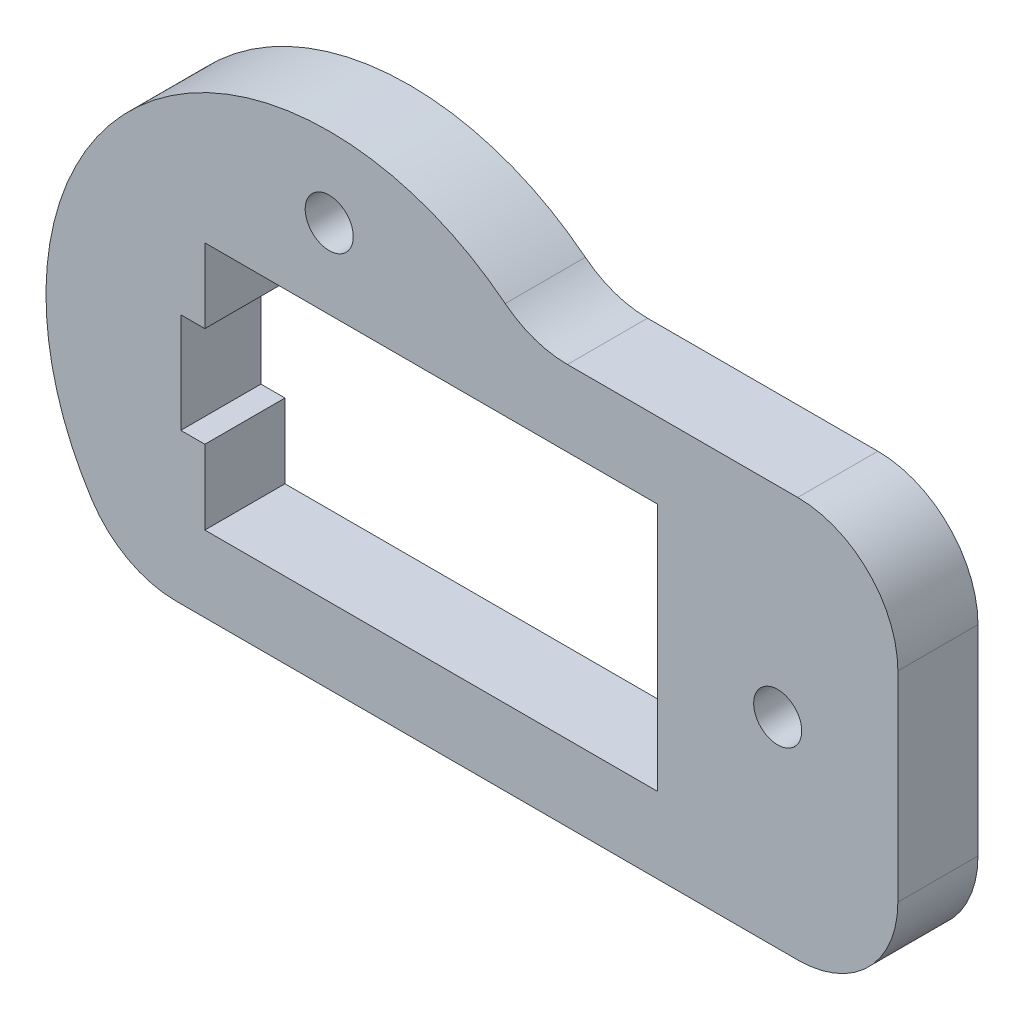
ISO-10303-21;
HEADER;
FILE_DESCRIPTION(('STEP AP214'),'2;1');
FILE_NAME('part.step','',(''),(''),'','','');
FILE_SCHEMA(('AUTOMOTIVE_DESIGN { 1 0 10303 214 1 1 1 1 }'));
ENDSEC;
DATA;
#1=APPLICATION_CONTEXT('core data for automotive mechanical design processes');
#2=APPLICATION_PROTOCOL_DEFINITION('international standard','automotive_design',2000,#1);
#3=PRODUCT_CONTEXT('',#1,'mechanical');
#4=PRODUCT('Part','Part','',(#3));
#5=PRODUCT_RELATED_PRODUCT_CATEGORY('part','',(#4));
#6=PRODUCT_DEFINITION_FORMATION('','',#4);
#7=PRODUCT_DEFINITION_CONTEXT('part definition',#1,'design');
#8=PRODUCT_DEFINITION('design','',#6,#7);
#9=PRODUCT_DEFINITION_SHAPE('','',#8);
#10=(LENGTH_UNIT() NAMED_UNIT(*) SI_UNIT(.MILLI.,.METRE.));
#11=(NAMED_UNIT(*) PLANE_ANGLE_UNIT() SI_UNIT($,.RADIAN.));
#12=(NAMED_UNIT(*) SI_UNIT($,.STERADIAN.) SOLID_ANGLE_UNIT());
#13=UNCERTAINTY_MEASURE_WITH_UNIT(LENGTH_MEASURE(1.E-05),#10,'distance_accuracy_value','');
#14=(GEOMETRIC_REPRESENTATION_CONTEXT(3) GLOBAL_UNCERTAINTY_ASSIGNED_CONTEXT((#13)) GLOBAL_UNIT_ASSIGNED_CONTEXT((#10,
#11,#12)) REPRESENTATION_CONTEXT('',''));
#15=CARTESIAN_POINT('',(0.,0.,0.));
#16=DIRECTION('',(0.,0.,1.));
#17=DIRECTION('',(1.,0.,0.));
#18=AXIS2_PLACEMENT_3D('',#15,#16,#17);
#19=CARTESIAN_POINT('',(0.,16.21,4.));
#20=DIRECTION('',(0.,1.,0.));
#21=DIRECTION('',(0.,0.,1.));
#22=AXIS2_PLACEMENT_3D('',#19,#20,#21);
#23=PLANE('',#22);
#24=DIRECTION('',(1.,0.,0.));
#25=VECTOR('',#24,1.);
#26=CARTESIAN_POINT('',(0.,16.21,0.));
#27=LINE('',#26,#25);
#28=CARTESIAN_POINT('',(3.78999999999999,16.21,0.));
#29=VERTEX_POINT('',#28);
#30=CARTESIAN_POINT('',(26.39,16.21,0.));
#31=VERTEX_POINT('',#30);
#32=EDGE_CURVE('E174',#29,#31,#27,.T.);
#33=ORIENTED_EDGE('',*,*,#32,.T.);
#34=DIRECTION('',(0.,0.,-1.));
#35=VECTOR('',#34,1.);
#36=CARTESIAN_POINT('',(26.39,16.21,4.));
#37=LINE('',#36,#35);
#38=CARTESIAN_POINT('',(26.39,16.21,4.));
#39=VERTEX_POINT('',#38);
#40=EDGE_CURVE('E154',#39,#31,#37,.T.);
#41=ORIENTED_EDGE('',*,*,#40,.F.);
#42=DIRECTION('',(1.,0.,0.));
#43=VECTOR('',#42,1.);
#44=CARTESIAN_POINT('',(0.,16.21,4.));
#45=LINE('',#44,#43);
#46=CARTESIAN_POINT('',(3.78999999999999,16.21,4.));
#47=VERTEX_POINT('',#46);
#48=EDGE_CURVE('E161',#47,#39,#45,.T.);
#49=ORIENTED_EDGE('',*,*,#48,.F.);
#50=DIRECTION('',(0.,0.,-1.));
#51=VECTOR('',#50,1.);
#52=CARTESIAN_POINT('',(3.78999999999999,16.21,4.));
#53=LINE('',#52,#51);
#54=EDGE_CURVE('E263',#47,#29,#53,.T.);
#55=ORIENTED_EDGE('',*,*,#54,.T.);
#56=EDGE_LOOP('',(#33,#41,#49,#55));
#57=FACE_BOUND('',#56,.T.);
#58=ADVANCED_FACE('F35',(#57),#23,.F.);
#59=CARTESIAN_POINT('',(26.39,0.,4.));
#60=DIRECTION('',(1.,0.,0.));
#61=DIRECTION('',(0.,0.,-1.));
#62=AXIS2_PLACEMENT_3D('',#59,#60,#61);
#63=PLANE('',#62);
#64=DIRECTION('',(0.,-1.,0.));
#65=VECTOR('',#64,1.);
#66=CARTESIAN_POINT('',(26.39,0.,0.));
#67=LINE('',#66,#65);
#68=CARTESIAN_POINT('',(26.39,3.79,0.));
#69=VERTEX_POINT('',#68);
#70=EDGE_CURVE('E275',#31,#69,#67,.T.);
#71=ORIENTED_EDGE('',*,*,#70,.T.);
#72=DIRECTION('',(0.,0.,-1.));
#73=VECTOR('',#72,1.);
#74=CARTESIAN_POINT('',(26.39,3.79,4.));
#75=LINE('',#74,#73);
#76=CARTESIAN_POINT('',(26.39,3.79,4.));
#77=VERTEX_POINT('',#76);
#78=EDGE_CURVE('E156',#77,#69,#75,.T.);
#79=ORIENTED_EDGE('',*,*,#78,.F.);
#80=DIRECTION('',(0.,-1.,0.));
#81=VECTOR('',#80,1.);
#82=CARTESIAN_POINT('',(26.39,0.,4.));
#83=LINE('',#82,#81);
#84=EDGE_CURVE('E149',#39,#77,#83,.T.);
#85=ORIENTED_EDGE('',*,*,#84,.F.);
#86=ORIENTED_EDGE('',*,*,#40,.T.);
#87=EDGE_LOOP('',(#71,#79,#85,#86));
#88=FACE_BOUND('',#87,.T.);
#89=ADVANCED_FACE('F152',(#88),#63,.F.);
#90=CARTESIAN_POINT('',(0.,3.79,4.));
#91=DIRECTION('',(0.,1.,0.));
#92=DIRECTION('',(-1.,0.,0.));
#93=AXIS2_PLACEMENT_3D('',#90,#91,#92);
#94=PLANE('',#93);
#95=DIRECTION('',(1.,0.,0.));
#96=VECTOR('',#95,1.);
#97=CARTESIAN_POINT('',(0.,3.79,0.));
#98=LINE('',#97,#96);
#99=CARTESIAN_POINT('',(3.78999999999999,3.79,0.));
#100=VERTEX_POINT('',#99);
#101=EDGE_CURVE('E277',#100,#69,#98,.T.);
#102=ORIENTED_EDGE('',*,*,#101,.F.);
#103=DIRECTION('',(0.,0.,-1.));
#104=VECTOR('',#103,1.);
#105=CARTESIAN_POINT('',(3.78999999999999,3.79,4.));
#106=LINE('',#105,#104);
#107=CARTESIAN_POINT('',(3.78999999999999,3.79,4.));
#108=VERTEX_POINT('',#107);
#109=EDGE_CURVE('E179',#108,#100,#106,.T.);
#110=ORIENTED_EDGE('',*,*,#109,.F.);
#111=DIRECTION('',(1.,0.,0.));
#112=VECTOR('',#111,1.);
#113=CARTESIAN_POINT('',(0.,3.79,4.));
#114=LINE('',#113,#112);
#115=EDGE_CURVE('E160',#108,#77,#114,.T.);
#116=ORIENTED_EDGE('',*,*,#115,.T.);
#117=ORIENTED_EDGE('',*,*,#78,.T.);
#118=EDGE_LOOP('',(#102,#110,#116,#117));
#119=FACE_BOUND('',#118,.T.);
#120=ADVANCED_FACE('F309',(#119),#94,.T.);
#121=CARTESIAN_POINT('',(3.78999999999999,0.,4.));
#122=DIRECTION('',(1.,0.,0.));
#123=DIRECTION('',(0.,1.,0.));
#124=AXIS2_PLACEMENT_3D('',#121,#122,#123);
#125=PLANE('',#124);
#126=DIRECTION('',(0.,-1.,0.));
#127=VECTOR('',#126,1.);
#128=CARTESIAN_POINT('',(3.78999999999999,0.,0.));
#129=LINE('',#128,#127);
#130=CARTESIAN_POINT('',(3.78999999999999,7.5,0.));
#131=VERTEX_POINT('',#130);
#132=EDGE_CURVE('E280',#131,#100,#129,.T.);
#133=ORIENTED_EDGE('',*,*,#132,.F.);
#134=DIRECTION('',(0.,0.,-1.));
#135=VECTOR('',#134,1.);
#136=CARTESIAN_POINT('',(3.78999999999999,7.5,4.));
#137=LINE('',#136,#135);
#138=CARTESIAN_POINT('',(3.78999999999999,7.5,4.));
#139=VERTEX_POINT('',#138);
#140=EDGE_CURVE('E302',#139,#131,#137,.T.);
#141=ORIENTED_EDGE('',*,*,#140,.F.);
#142=DIRECTION('',(0.,-1.,0.));
#143=VECTOR('',#142,1.);
#144=CARTESIAN_POINT('',(3.78999999999999,0.,4.));
#145=LINE('',#144,#143);
#146=EDGE_CURVE('E250',#139,#108,#145,.T.);
#147=ORIENTED_EDGE('',*,*,#146,.T.);
#148=ORIENTED_EDGE('',*,*,#109,.T.);
#149=EDGE_LOOP('',(#133,#141,#147,#148));
#150=FACE_BOUND('',#149,.T.);
#151=ADVANCED_FACE('F306',(#150),#125,.T.);
#152=CARTESIAN_POINT('',(0.,7.5,4.));
#153=DIRECTION('',(0.,-1.,0.));
#154=DIRECTION('',(0.,0.,-1.));
#155=AXIS2_PLACEMENT_3D('',#152,#153,#154);
#156=PLANE('',#155);
#157=DIRECTION('',(-1.,0.,0.));
#158=VECTOR('',#157,1.);
#159=CARTESIAN_POINT('',(0.,7.5,0.));
#160=LINE('',#159,#158);
#161=CARTESIAN_POINT('',(2.59,7.5,0.));
#162=VERTEX_POINT('',#161);
#163=EDGE_CURVE('E283',#131,#162,#160,.T.);
#164=ORIENTED_EDGE('',*,*,#163,.T.);
#165=DIRECTION('',(0.,0.,-1.));
#166=VECTOR('',#165,1.);
#167=CARTESIAN_POINT('',(2.59,7.5,4.));
#168=LINE('',#167,#166);
#169=CARTESIAN_POINT('',(2.59,7.5,4.));
#170=VERTEX_POINT('',#169);
#171=EDGE_CURVE('E300',#170,#162,#168,.T.);
#172=ORIENTED_EDGE('',*,*,#171,.F.);
#173=DIRECTION('',(-1.,0.,0.));
#174=VECTOR('',#173,1.);
#175=CARTESIAN_POINT('',(0.,7.5,4.));
#176=LINE('',#175,#174);
#177=EDGE_CURVE('E253',#139,#170,#176,.T.);
#178=ORIENTED_EDGE('',*,*,#177,.F.);
#179=ORIENTED_EDGE('',*,*,#140,.T.);
#180=EDGE_LOOP('',(#164,#172,#178,#179));
#181=FACE_BOUND('',#180,.T.);
#182=ADVANCED_FACE('F316',(#181),#156,.F.);
#183=CARTESIAN_POINT('',(2.59,0.,4.));
#184=DIRECTION('',(1.,0.,0.));
#185=DIRECTION('',(0.,0.,-1.));
#186=AXIS2_PLACEMENT_3D('',#183,#184,#185);
#187=PLANE('',#186);
#188=DIRECTION('',(0.,-1.,0.));
#189=VECTOR('',#188,1.);
#190=CARTESIAN_POINT('',(2.59,0.,0.));
#191=LINE('',#190,#189);
#192=CARTESIAN_POINT('',(2.59,12.5,0.));
#193=VERTEX_POINT('',#192);
#194=EDGE_CURVE('E287',#193,#162,#191,.T.);
#195=ORIENTED_EDGE('',*,*,#194,.F.);
#196=DIRECTION('',(0.,0.,-1.));
#197=VECTOR('',#196,1.);
#198=CARTESIAN_POINT('',(2.59,12.5,4.));
#199=LINE('',#198,#197);
#200=CARTESIAN_POINT('',(2.59,12.5,4.));
#201=VERTEX_POINT('',#200);
#202=EDGE_CURVE('E298',#201,#193,#199,.T.);
#203=ORIENTED_EDGE('',*,*,#202,.F.);
#204=DIRECTION('',(0.,-1.,0.));
#205=VECTOR('',#204,1.);
#206=CARTESIAN_POINT('',(2.59,0.,4.));
#207=LINE('',#206,#205);
#208=EDGE_CURVE('E255',#201,#170,#207,.T.);
#209=ORIENTED_EDGE('',*,*,#208,.T.);
#210=ORIENTED_EDGE('',*,*,#171,.T.);
#211=EDGE_LOOP('',(#195,#203,#209,#210));
#212=FACE_BOUND('',#211,.T.);
#213=ADVANCED_FACE('F465',(#212),#187,.T.);
#214=CARTESIAN_POINT('',(0.,12.5,4.));
#215=DIRECTION('',(0.,-1.,0.));
#216=DIRECTION('',(0.,0.,-1.));
#217=AXIS2_PLACEMENT_3D('',#214,#215,#216);
#218=PLANE('',#217);
#219=DIRECTION('',(-1.,0.,0.));
#220=VECTOR('',#219,1.);
#221=CARTESIAN_POINT('',(0.,12.5,0.));
#222=LINE('',#221,#220);
#223=CARTESIAN_POINT('',(3.78999999999999,12.5,0.));
#224=VERTEX_POINT('',#223);
#225=EDGE_CURVE('E290',#224,#193,#222,.T.);
#226=ORIENTED_EDGE('',*,*,#225,.F.);
#227=DIRECTION('',(0.,0.,-1.));
#228=VECTOR('',#227,1.);
#229=CARTESIAN_POINT('',(3.78999999999999,12.5,4.));
#230=LINE('',#229,#228);
#231=CARTESIAN_POINT('',(3.78999999999999,12.5,4.));
#232=VERTEX_POINT('',#231);
#233=EDGE_CURVE('E296',#232,#224,#230,.T.);
#234=ORIENTED_EDGE('',*,*,#233,.F.);
#235=DIRECTION('',(-1.,0.,0.));
#236=VECTOR('',#235,1.);
#237=CARTESIAN_POINT('',(0.,12.5,4.));
#238=LINE('',#237,#236);
#239=EDGE_CURVE('E258',#232,#201,#238,.T.);
#240=ORIENTED_EDGE('',*,*,#239,.T.);
#241=ORIENTED_EDGE('',*,*,#202,.T.);
#242=EDGE_LOOP('',(#226,#234,#240,#241));
#243=FACE_BOUND('',#242,.T.);
#244=ADVANCED_FACE('F322',(#243),#218,.T.);
#245=CARTESIAN_POINT('',(0.,20.,4.));
#246=DIRECTION('',(0.,1.,0.));
#247=DIRECTION('',(-1.,0.,0.));
#248=AXIS2_PLACEMENT_3D('',#245,#246,#247);
#249=PLANE('',#248);
#250=DIRECTION('',(1.,0.,0.));
#251=VECTOR('',#250,1.);
#252=CARTESIAN_POINT('',(0.,20.,4.));
#253=LINE('',#252,#251);
#254=CARTESIAN_POINT('',(21.8920711500272,20.,4.));
#255=VERTEX_POINT('',#254);
#256=CARTESIAN_POINT('',(33.39,20.,4.));
#257=VERTEX_POINT('',#256);
#258=EDGE_CURVE('E234',#255,#257,#253,.T.);
#259=ORIENTED_EDGE('',*,*,#258,.T.);
#260=DIRECTION('',(0.,0.,-1.));
#261=VECTOR('',#260,1.);
#262=CARTESIAN_POINT('',(33.39,20.,4.));
#263=LINE('',#262,#261);
#264=CARTESIAN_POINT('',(33.39,20.,0.));
#265=VERTEX_POINT('',#264);
#266=EDGE_CURVE('E207',#257,#265,#263,.T.);
#267=ORIENTED_EDGE('',*,*,#266,.T.);
#268=DIRECTION('',(1.,0.,0.));
#269=VECTOR('',#268,1.);
#270=CARTESIAN_POINT('',(0.,20.,0.));
#271=LINE('',#270,#269);
#272=CARTESIAN_POINT('',(21.8920711500272,20.,0.));
#273=VERTEX_POINT('',#272);
#274=EDGE_CURVE('E216',#273,#265,#271,.T.);
#275=ORIENTED_EDGE('',*,*,#274,.F.);
#276=DIRECTION('',(0.,0.,-1.));
#277=VECTOR('',#276,1.);
#278=CARTESIAN_POINT('',(21.8920711500272,20.,4.));
#279=LINE('',#278,#277);
#280=EDGE_CURVE('E205',#273,#255,#279,.F.);
#281=ORIENTED_EDGE('',*,*,#280,.T.);
#282=EDGE_LOOP('',(#259,#267,#275,#281));
#283=FACE_BOUND('',#282,.T.);
#284=ADVANCED_FACE('F224',(#283),#249,.T.);
#285=CARTESIAN_POINT('',(10.,10.,4.));
#286=DIRECTION('',(0.,0.,-1.));
#287=DIRECTION('',(-1.,0.,0.));
#288=AXIS2_PLACEMENT_3D('',#285,#286,#287);
#289=CYLINDRICAL_SURFACE('',#288,14.1421356237309);
#290=CARTESIAN_POINT('',(10.,10.,0.));
#291=DIRECTION('',(0.,0.,1.));
#292=DIRECTION('',(1.,0.,0.));
#293=AXIS2_PLACEMENT_3D('',#290,#291,#292);
#294=CIRCLE('',#293,14.1421356237309);
#295=CARTESIAN_POINT('',(18.7858160842956,21.0819418755439,0.));
#296=VERTEX_POINT('',#295);
#297=CARTESIAN_POINT('',(-1.83959902632313,2.26540919660985,0.));
#298=VERTEX_POINT('',#297);
#299=EDGE_CURVE('E218',#296,#298,#294,.T.);
#300=ORIENTED_EDGE('',*,*,#299,.T.);
#301=DIRECTION('',(0.,0.,-1.));
#302=VECTOR('',#301,1.);
#303=CARTESIAN_POINT('',(-1.83959902632313,2.26540919660985,4.));
#304=LINE('',#303,#302);
#305=CARTESIAN_POINT('',(-1.83959902632313,2.26540919660985,4.));
#306=VERTEX_POINT('',#305);
#307=EDGE_CURVE('E194',#298,#306,#304,.F.);
#308=ORIENTED_EDGE('',*,*,#307,.T.);
#309=CARTESIAN_POINT('',(10.,10.,4.));
#310=DIRECTION('',(0.,0.,1.));
#311=DIRECTION('',(1.,0.,0.));
#312=AXIS2_PLACEMENT_3D('',#309,#310,#311);
#313=CIRCLE('',#312,14.1421356237309);
#314=CARTESIAN_POINT('',(18.7858160842956,21.0819418755439,4.));
#315=VERTEX_POINT('',#314);
#316=EDGE_CURVE('E232',#315,#306,#313,.T.);
#317=ORIENTED_EDGE('',*,*,#316,.F.);
#318=DIRECTION('',(0.,0.,-1.));
#319=VECTOR('',#318,1.);
#320=CARTESIAN_POINT('',(18.7858160842956,21.0819418755439,4.));
#321=LINE('',#320,#319);
#322=EDGE_CURVE('E191',#315,#296,#321,.T.);
#323=ORIENTED_EDGE('',*,*,#322,.T.);
#324=EDGE_LOOP('',(#300,#308,#317,#323));
#325=FACE_BOUND('',#324,.T.);
#326=ADVANCED_FACE('F236',(#325),#289,.T.);
#327=CARTESIAN_POINT('',(0.,0.,4.));
#328=DIRECTION('',(0.,-1.,0.));
#329=DIRECTION('',(1.,0.,0.));
#330=AXIS2_PLACEMENT_3D('',#327,#328,#329);
#331=PLANE('',#330);
#332=DIRECTION('',(-1.,0.,0.));
#333=VECTOR('',#332,1.);
#334=CARTESIAN_POINT('',(0.,0.,4.));
#335=LINE('',#334,#333);
#336=CARTESIAN_POINT('',(33.39,0.,4.));
#337=VERTEX_POINT('',#336);
#338=CARTESIAN_POINT('',(2.34633135269824,0.,4.));
#339=VERTEX_POINT('',#338);
#340=EDGE_CURVE('E238',#337,#339,#335,.T.);
#341=ORIENTED_EDGE('',*,*,#340,.T.);
#342=DIRECTION('',(0.,0.,1.));
#343=VECTOR('',#342,1.);
#344=CARTESIAN_POINT('',(2.34633135269824,0.,0.));
#345=LINE('',#344,#343);
#346=CARTESIAN_POINT('',(2.34633135269824,0.,0.));
#347=VERTEX_POINT('',#346);
#348=EDGE_CURVE('E177',#339,#347,#345,.F.);
#349=ORIENTED_EDGE('',*,*,#348,.T.);
#350=DIRECTION('',(-1.,0.,0.));
#351=VECTOR('',#350,1.);
#352=CARTESIAN_POINT('',(0.,0.,0.));
#353=LINE('',#352,#351);
#354=CARTESIAN_POINT('',(33.39,0.,0.));
#355=VERTEX_POINT('',#354);
#356=EDGE_CURVE('E266',#355,#347,#353,.T.);
#357=ORIENTED_EDGE('',*,*,#356,.F.);
#358=DIRECTION('',(0.,0.,-1.));
#359=VECTOR('',#358,1.);
#360=CARTESIAN_POINT('',(33.39,0.,4.));
#361=LINE('',#360,#359);
#362=EDGE_CURVE('E175',#355,#337,#361,.F.);
#363=ORIENTED_EDGE('',*,*,#362,.T.);
#364=EDGE_LOOP('',(#341,#349,#357,#363));
#365=FACE_BOUND('',#364,.T.);
#366=ADVANCED_FACE('F329',(#365),#331,.T.);
#367=EDGE_CURVE('E284',#29,#224,#129,.T.);
#368=ORIENTED_EDGE('',*,*,#367,.F.);
#369=ORIENTED_EDGE('',*,*,#54,.F.);
#370=EDGE_CURVE('E169',#47,#232,#145,.T.);
#371=ORIENTED_EDGE('',*,*,#370,.T.);
#372=ORIENTED_EDGE('',*,*,#233,.T.);
#373=EDGE_LOOP('',(#368,#369,#371,#372));
#374=FACE_BOUND('',#373,.T.);
#375=ADVANCED_FACE('F326',(#374),#125,.T.);
#376=CARTESIAN_POINT('',(10.,20.1760678118655,4.));
#377=DIRECTION('',(0.,0.,-1.));
#378=DIRECTION('',(-1.,0.,0.));
#379=AXIS2_PLACEMENT_3D('',#376,#377,#378);
#380=CYLINDRICAL_SURFACE('',#379,1.2);
#381=CARTESIAN_POINT('',(10.,20.1760678118655,4.));
#382=DIRECTION('',(0.,0.,1.));
#383=DIRECTION('',(1.,0.,0.));
#384=AXIS2_PLACEMENT_3D('',#381,#382,#383);
#385=CIRCLE('',#384,1.2);
#386=CARTESIAN_POINT('',(11.2,20.1760678118655,4.));
#387=VERTEX_POINT('',#386);
#388=EDGE_CURVE('E171',#387,#387,#385,.T.);
#389=ORIENTED_EDGE('',*,*,#388,.T.);
#390=EDGE_LOOP('',(#389));
#391=FACE_BOUND('',#390,.T.);
#392=CARTESIAN_POINT('',(10.,20.1760678118655,0.));
#393=DIRECTION('',(0.,0.,1.));
#394=DIRECTION('',(1.,0.,0.));
#395=AXIS2_PLACEMENT_3D('',#392,#393,#394);
#396=CIRCLE('',#395,1.2);
#397=CARTESIAN_POINT('',(11.2,20.1760678118655,0.));
#398=VERTEX_POINT('',#397);
#399=EDGE_CURVE('E271',#398,#398,#396,.T.);
#400=ORIENTED_EDGE('',*,*,#399,.F.);
#401=EDGE_LOOP('',(#400));
#402=FACE_BOUND('',#401,.T.);
#403=ADVANCED_FACE('F328',(#391,#402),#380,.F.);
#404=CARTESIAN_POINT('',(38.39,0.,4.));
#405=DIRECTION('',(1.,0.,0.));
#406=DIRECTION('',(0.,0.,-1.));
#407=AXIS2_PLACEMENT_3D('',#404,#405,#406);
#408=PLANE('',#407);
#409=DIRECTION('',(0.,-1.,0.));
#410=VECTOR('',#409,1.);
#411=CARTESIAN_POINT('',(38.39,0.,4.));
#412=LINE('',#411,#410);
#413=CARTESIAN_POINT('',(38.39,15.,4.));
#414=VERTEX_POINT('',#413);
#415=CARTESIAN_POINT('',(38.39,5.,4.));
#416=VERTEX_POINT('',#415);
#417=EDGE_CURVE('E241',#414,#416,#412,.T.);
#418=ORIENTED_EDGE('',*,*,#417,.T.);
#419=DIRECTION('',(0.,0.,-1.));
#420=VECTOR('',#419,1.);
#421=CARTESIAN_POINT('',(38.39,5.,4.));
#422=LINE('',#421,#420);
#423=CARTESIAN_POINT('',(38.39,5.,0.));
#424=VERTEX_POINT('',#423);
#425=EDGE_CURVE('E202',#416,#424,#422,.T.);
#426=ORIENTED_EDGE('',*,*,#425,.T.);
#427=DIRECTION('',(0.,-1.,0.));
#428=VECTOR('',#427,1.);
#429=CARTESIAN_POINT('',(38.39,0.,0.));
#430=LINE('',#429,#428);
#431=CARTESIAN_POINT('',(38.39,15.,0.));
#432=VERTEX_POINT('',#431);
#433=EDGE_CURVE('E268',#432,#424,#430,.T.);
#434=ORIENTED_EDGE('',*,*,#433,.F.);
#435=DIRECTION('',(0.,0.,-1.));
#436=VECTOR('',#435,1.);
#437=CARTESIAN_POINT('',(38.39,15.,4.));
#438=LINE('',#437,#436);
#439=EDGE_CURVE('E57',#432,#414,#438,.F.);
#440=ORIENTED_EDGE('',*,*,#439,.T.);
#441=EDGE_LOOP('',(#418,#426,#434,#440));
#442=FACE_BOUND('',#441,.T.);
#443=ADVANCED_FACE('F335',(#442),#408,.T.);
#444=CARTESIAN_POINT('',(32.39,10.,4.));
#445=DIRECTION('',(0.,0.,-1.));
#446=DIRECTION('',(-1.,0.,0.));
#447=AXIS2_PLACEMENT_3D('',#444,#445,#446);
#448=CYLINDRICAL_SURFACE('',#447,1.2);
#449=CARTESIAN_POINT('',(32.39,10.,4.));
#450=DIRECTION('',(0.,0.,1.));
#451=DIRECTION('',(1.,0.,0.));
#452=AXIS2_PLACEMENT_3D('',#449,#450,#451);
#453=CIRCLE('',#452,1.2);
#454=CARTESIAN_POINT('',(33.59,10.,4.));
#455=VERTEX_POINT('',#454);
#456=EDGE_CURVE('E261',#455,#455,#453,.T.);
#457=ORIENTED_EDGE('',*,*,#456,.T.);
#458=EDGE_LOOP('',(#457));
#459=FACE_BOUND('',#458,.T.);
#460=CARTESIAN_POINT('',(32.39,10.,0.));
#461=DIRECTION('',(0.,0.,1.));
#462=DIRECTION('',(1.,0.,0.));
#463=AXIS2_PLACEMENT_3D('',#460,#461,#462);
#464=CIRCLE('',#463,1.2);
#465=CARTESIAN_POINT('',(33.59,10.,0.));
#466=VERTEX_POINT('',#465);
#467=EDGE_CURVE('E243',#466,#466,#464,.T.);
#468=ORIENTED_EDGE('',*,*,#467,.F.);
#469=EDGE_LOOP('',(#468));
#470=FACE_BOUND('',#469,.T.);
#471=ADVANCED_FACE('F352',(#459,#470),#448,.F.);
#472=CARTESIAN_POINT('',(0.,0.,4.));
#473=DIRECTION('',(0.,0.,1.));
#474=DIRECTION('',(1.,0.,0.));
#475=AXIS2_PLACEMENT_3D('',#472,#473,#474);
#476=PLANE('',#475);
#477=ORIENTED_EDGE('',*,*,#316,.T.);
#478=CARTESIAN_POINT('',(2.34633135269824,5.,4.));
#479=DIRECTION('',(0.,0.,1.));
#480=DIRECTION('',(1.,0.,0.));
#481=AXIS2_PLACEMENT_3D('',#478,#479,#480);
#482=CIRCLE('',#481,5.);
#483=EDGE_CURVE('E199',#306,#339,#482,.T.);
#484=ORIENTED_EDGE('',*,*,#483,.T.);
#485=ORIENTED_EDGE('',*,*,#340,.F.);
#486=CARTESIAN_POINT('',(33.39,5.,4.));
#487=DIRECTION('',(0.,0.,1.));
#488=DIRECTION('',(1.,0.,0.));
#489=AXIS2_PLACEMENT_3D('',#486,#487,#488);
#490=CIRCLE('',#489,5.);
#491=EDGE_CURVE('E50',#337,#416,#490,.T.);
#492=ORIENTED_EDGE('',*,*,#491,.T.);
#493=ORIENTED_EDGE('',*,*,#417,.F.);
#494=CARTESIAN_POINT('',(33.39,15.,4.));
#495=DIRECTION('',(0.,0.,1.));
#496=DIRECTION('',(1.,0.,0.));
#497=AXIS2_PLACEMENT_3D('',#494,#495,#496);
#498=CIRCLE('',#497,5.);
#499=EDGE_CURVE('E196',#414,#257,#498,.T.);
#500=ORIENTED_EDGE('',*,*,#499,.T.);
#501=ORIENTED_EDGE('',*,*,#258,.F.);
#502=CARTESIAN_POINT('',(21.8920711500272,25.,4.));
#503=DIRECTION('',(0.,0.,1.));
#504=DIRECTION('',(1.,0.,0.));
#505=AXIS2_PLACEMENT_3D('',#502,#503,#504);
#506=CIRCLE('',#505,5.);
#507=EDGE_CURVE('E11',#255,#315,#506,.F.);
#508=ORIENTED_EDGE('',*,*,#507,.T.);
#509=EDGE_LOOP('',(#477,#484,#485,#492,#493,#500,#501,#508));
#510=FACE_BOUND('',#509,.T.);
#511=ORIENTED_EDGE('',*,*,#388,.F.);
#512=EDGE_LOOP('',(#511));
#513=FACE_BOUND('',#512,.T.);
#514=ORIENTED_EDGE('',*,*,#48,.T.);
#515=ORIENTED_EDGE('',*,*,#84,.T.);
#516=ORIENTED_EDGE('',*,*,#115,.F.);
#517=ORIENTED_EDGE('',*,*,#146,.F.);
#518=ORIENTED_EDGE('',*,*,#177,.T.);
#519=ORIENTED_EDGE('',*,*,#208,.F.);
#520=ORIENTED_EDGE('',*,*,#239,.F.);
#521=ORIENTED_EDGE('',*,*,#370,.F.);
#522=EDGE_LOOP('',(#514,#515,#516,#517,#518,#519,#520,#521));
#523=FACE_BOUND('',#522,.T.);
#524=ORIENTED_EDGE('',*,*,#456,.F.);
#525=EDGE_LOOP('',(#524));
#526=FACE_BOUND('',#525,.T.);
#527=ADVANCED_FACE('F165',(#510,#513,#523,#526),#476,.T.);
#528=CARTESIAN_POINT('',(0.,0.,0.));
#529=DIRECTION('',(0.,0.,1.));
#530=DIRECTION('',(1.,0.,0.));
#531=AXIS2_PLACEMENT_3D('',#528,#529,#530);
#532=PLANE('',#531);
#533=ORIENTED_EDGE('',*,*,#356,.T.);
#534=CARTESIAN_POINT('',(2.34633135269824,5.,0.));
#535=DIRECTION('',(0.,0.,1.));
#536=DIRECTION('',(1.,0.,0.));
#537=AXIS2_PLACEMENT_3D('',#534,#535,#536);
#538=CIRCLE('',#537,5.);
#539=EDGE_CURVE('E189',#347,#298,#538,.F.);
#540=ORIENTED_EDGE('',*,*,#539,.T.);
#541=ORIENTED_EDGE('',*,*,#299,.F.);
#542=CARTESIAN_POINT('',(21.8920711500272,25.,0.));
#543=DIRECTION('',(0.,0.,1.));
#544=DIRECTION('',(1.,0.,0.));
#545=AXIS2_PLACEMENT_3D('',#542,#543,#544);
#546=CIRCLE('',#545,5.);
#547=EDGE_CURVE('E43',#296,#273,#546,.T.);
#548=ORIENTED_EDGE('',*,*,#547,.T.);
#549=ORIENTED_EDGE('',*,*,#274,.T.);
#550=CARTESIAN_POINT('',(33.39,15.,0.));
#551=DIRECTION('',(0.,0.,1.));
#552=DIRECTION('',(1.,0.,0.));
#553=AXIS2_PLACEMENT_3D('',#550,#551,#552);
#554=CIRCLE('',#553,5.);
#555=EDGE_CURVE('E185',#265,#432,#554,.F.);
#556=ORIENTED_EDGE('',*,*,#555,.T.);
#557=ORIENTED_EDGE('',*,*,#433,.T.);
#558=CARTESIAN_POINT('',(33.39,5.,0.));
#559=DIRECTION('',(0.,0.,1.));
#560=DIRECTION('',(1.,0.,0.));
#561=AXIS2_PLACEMENT_3D('',#558,#559,#560);
#562=CIRCLE('',#561,5.);
#563=EDGE_CURVE('E187',#424,#355,#562,.F.);
#564=ORIENTED_EDGE('',*,*,#563,.T.);
#565=EDGE_LOOP('',(#533,#540,#541,#548,#549,#556,#557,#564));
#566=FACE_BOUND('',#565,.T.);
#567=ORIENTED_EDGE('',*,*,#399,.T.);
#568=EDGE_LOOP('',(#567));
#569=FACE_BOUND('',#568,.T.);
#570=ORIENTED_EDGE('',*,*,#32,.F.);
#571=ORIENTED_EDGE('',*,*,#367,.T.);
#572=ORIENTED_EDGE('',*,*,#225,.T.);
#573=ORIENTED_EDGE('',*,*,#194,.T.);
#574=ORIENTED_EDGE('',*,*,#163,.F.);
#575=ORIENTED_EDGE('',*,*,#132,.T.);
#576=ORIENTED_EDGE('',*,*,#101,.T.);
#577=ORIENTED_EDGE('',*,*,#70,.F.);
#578=EDGE_LOOP('',(#570,#571,#572,#573,#574,#575,#576,#577));
#579=FACE_BOUND('',#578,.T.);
#580=ORIENTED_EDGE('',*,*,#467,.T.);
#581=EDGE_LOOP('',(#580));
#582=FACE_BOUND('',#581,.T.);
#583=ADVANCED_FACE('F214',(#566,#569,#579,#582),#532,.F.);
#584=CARTESIAN_POINT('',(2.34633135269824,5.,4.));
#585=DIRECTION('',(0.,0.,-1.));
#586=DIRECTION('',(-1.,0.,0.));
#587=AXIS2_PLACEMENT_3D('',#584,#585,#586);
#588=CYLINDRICAL_SURFACE('',#587,5.);
#589=ORIENTED_EDGE('',*,*,#483,.F.);
#590=ORIENTED_EDGE('',*,*,#307,.F.);
#591=ORIENTED_EDGE('',*,*,#539,.F.);
#592=ORIENTED_EDGE('',*,*,#348,.F.);
#593=EDGE_LOOP('',(#589,#590,#591,#592));
#594=FACE_BOUND('',#593,.T.);
#595=ADVANCED_FACE('F358',(#594),#588,.T.);
#596=CARTESIAN_POINT('',(33.39,5.,4.));
#597=DIRECTION('',(0.,0.,-1.));
#598=DIRECTION('',(-1.,0.,0.));
#599=AXIS2_PLACEMENT_3D('',#596,#597,#598);
#600=CYLINDRICAL_SURFACE('',#599,5.);
#601=ORIENTED_EDGE('',*,*,#491,.F.);
#602=ORIENTED_EDGE('',*,*,#362,.F.);
#603=ORIENTED_EDGE('',*,*,#563,.F.);
#604=ORIENTED_EDGE('',*,*,#425,.F.);
#605=EDGE_LOOP('',(#601,#602,#603,#604));
#606=FACE_BOUND('',#605,.T.);
#607=ADVANCED_FACE('F361',(#606),#600,.T.);
#608=CARTESIAN_POINT('',(33.39,15.,4.));
#609=DIRECTION('',(0.,0.,-1.));
#610=DIRECTION('',(-1.,0.,0.));
#611=AXIS2_PLACEMENT_3D('',#608,#609,#610);
#612=CYLINDRICAL_SURFACE('',#611,5.);
#613=ORIENTED_EDGE('',*,*,#499,.F.);
#614=ORIENTED_EDGE('',*,*,#439,.F.);
#615=ORIENTED_EDGE('',*,*,#555,.F.);
#616=ORIENTED_EDGE('',*,*,#266,.F.);
#617=EDGE_LOOP('',(#613,#614,#615,#616));
#618=FACE_BOUND('',#617,.T.);
#619=ADVANCED_FACE('F364',(#618),#612,.T.);
#620=CARTESIAN_POINT('',(21.8920711500272,25.,4.));
#621=DIRECTION('',(0.,0.,-1.));
#622=DIRECTION('',(-1.,0.,0.));
#623=AXIS2_PLACEMENT_3D('',#620,#621,#622);
#624=CYLINDRICAL_SURFACE('',#623,5.);
#625=ORIENTED_EDGE('',*,*,#507,.F.);
#626=ORIENTED_EDGE('',*,*,#280,.F.);
#627=ORIENTED_EDGE('',*,*,#547,.F.);
#628=ORIENTED_EDGE('',*,*,#322,.F.);
#629=EDGE_LOOP('',(#625,#626,#627,#628));
#630=FACE_BOUND('',#629,.T.);
#631=ADVANCED_FACE('F37',(#630),#624,.F.);
#632=CLOSED_SHELL('',(#58,#89,#120,#151,#182,#213,#244,#284,#326,#366,#375,#403,#443,#471,#527,
#583,#595,#607,#619,#631));
#633=MANIFOLD_SOLID_BREP('B2',#632);
#634=ADVANCED_BREP_SHAPE_REPRESENTATION('',(#18,#633),#14);
#635=SHAPE_DEFINITION_REPRESENTATION(#9,#634);
ENDSEC;
END-ISO-10303-21;
